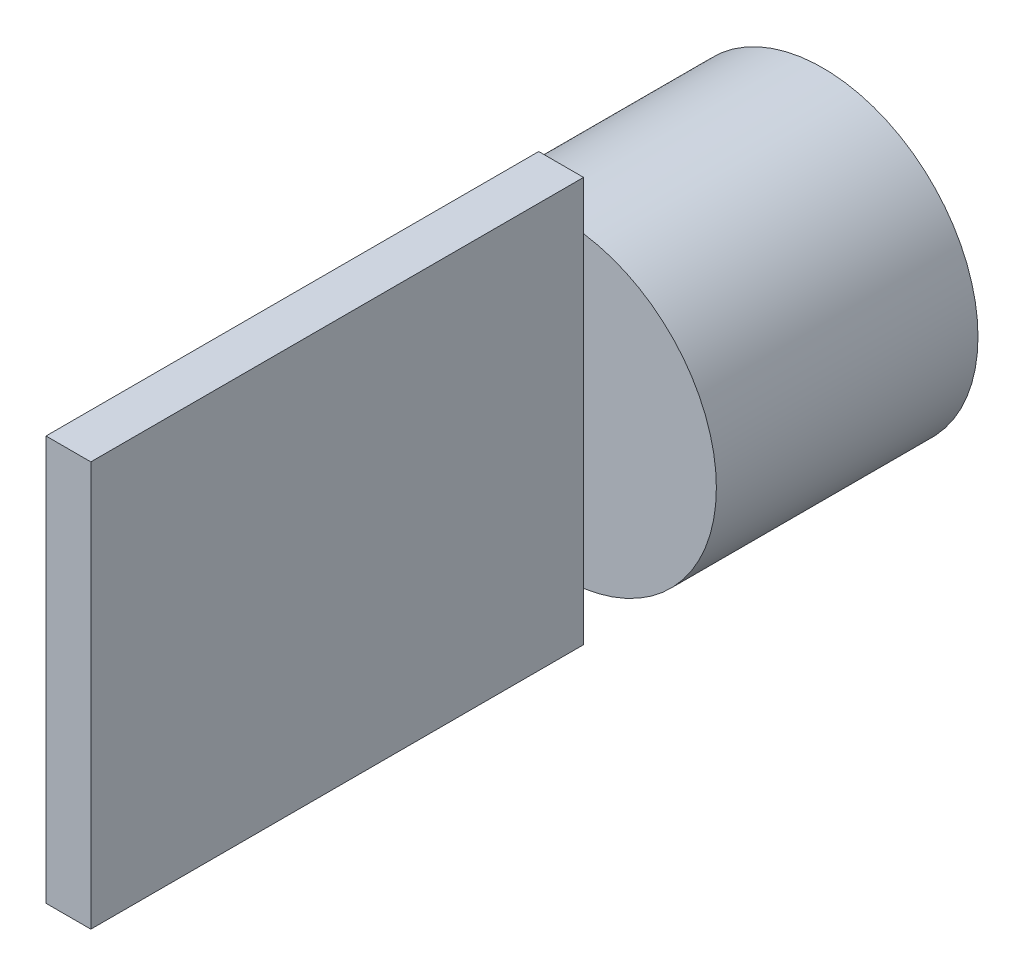
ISO-10303-21;
HEADER;
FILE_DESCRIPTION(('STEP AP214'),'2;1');
FILE_NAME('part.step','',(''),(''),'','','');
FILE_SCHEMA(('AUTOMOTIVE_DESIGN { 1 0 10303 214 1 1 1 1 }'));
ENDSEC;
DATA;
#1=APPLICATION_CONTEXT('core data for automotive mechanical design processes');
#2=APPLICATION_PROTOCOL_DEFINITION('international standard','automotive_design',2000,#1);
#3=PRODUCT_CONTEXT('',#1,'mechanical');
#4=PRODUCT('Part','Part','',(#3));
#5=PRODUCT_RELATED_PRODUCT_CATEGORY('part','',(#4));
#6=PRODUCT_DEFINITION_FORMATION('','',#4);
#7=PRODUCT_DEFINITION_CONTEXT('part definition',#1,'design');
#8=PRODUCT_DEFINITION('design','',#6,#7);
#9=PRODUCT_DEFINITION_SHAPE('','',#8);
#10=(LENGTH_UNIT() NAMED_UNIT(*) SI_UNIT(.MILLI.,.METRE.));
#11=(NAMED_UNIT(*) PLANE_ANGLE_UNIT() SI_UNIT($,.RADIAN.));
#12=(NAMED_UNIT(*) SI_UNIT($,.STERADIAN.) SOLID_ANGLE_UNIT());
#13=UNCERTAINTY_MEASURE_WITH_UNIT(LENGTH_MEASURE(1.E-05),#10,'distance_accuracy_value','');
#14=(GEOMETRIC_REPRESENTATION_CONTEXT(3) GLOBAL_UNCERTAINTY_ASSIGNED_CONTEXT((#13)) GLOBAL_UNIT_ASSIGNED_CONTEXT((#10,
#11,#12)) REPRESENTATION_CONTEXT('',''));
#15=CARTESIAN_POINT('',(0.,0.,0.));
#16=DIRECTION('',(0.,0.,1.));
#17=DIRECTION('',(1.,0.,0.));
#18=AXIS2_PLACEMENT_3D('',#15,#16,#17);
#19=CARTESIAN_POINT('',(0.,0.,60.));
#20=DIRECTION('',(0.,0.,1.));
#21=DIRECTION('',(1.,0.,0.));
#22=AXIS2_PLACEMENT_3D('',#19,#20,#21);
#23=PLANE('',#22);
#24=DIRECTION('',(0.,-1.,0.));
#25=VECTOR('',#24,1.);
#26=CARTESIAN_POINT('',(-5.14155313605641,46.4092822544037,60.));
#27=LINE('',#26,#25);
#28=CARTESIAN_POINT('',(-5.14155313605641,35.2267573209501,60.));
#29=VERTEX_POINT('',#28);
#30=CARTESIAN_POINT('',(-5.14155313605641,-35.2267573209501,60.));
#31=VERTEX_POINT('',#30);
#32=EDGE_CURVE('E11',#29,#31,#27,.T.);
#33=ORIENTED_EDGE('',*,*,#32,.F.);
#34=CARTESIAN_POINT('',(0.,0.,60.));
#35=DIRECTION('',(0.,0.,1.));
#36=DIRECTION('',(1.,0.,0.));
#37=AXIS2_PLACEMENT_3D('',#34,#35,#36);
#38=CIRCLE('',#37,35.6);
#39=EDGE_CURVE('E136',#29,#31,#38,.T.);
#40=ORIENTED_EDGE('',*,*,#39,.T.);
#41=EDGE_LOOP('',(#33,#40));
#42=FACE_BOUND('',#41,.T.);
#43=ADVANCED_FACE('F38',(#42),#23,.T.);
#44=CARTESIAN_POINT('',(0.,0.,60.));
#45=DIRECTION('',(0.,0.,-1.));
#46=DIRECTION('',(-1.,0.,0.));
#47=AXIS2_PLACEMENT_3D('',#44,#45,#46);
#48=CYLINDRICAL_SURFACE('',#47,35.6);
#49=CARTESIAN_POINT('',(5.14155313605641,35.2267573209501,60.));
#50=VERTEX_POINT('',#49);
#51=EDGE_CURVE('E133',#50,#29,#38,.T.);
#52=ORIENTED_EDGE('',*,*,#51,.F.);
#53=CARTESIAN_POINT('',(5.14155313605641,-35.2267573209501,60.));
#54=VERTEX_POINT('',#53);
#55=EDGE_CURVE('E129',#54,#50,#38,.T.);
#56=ORIENTED_EDGE('',*,*,#55,.F.);
#57=EDGE_CURVE('E63',#31,#54,#38,.T.);
#58=ORIENTED_EDGE('',*,*,#57,.F.);
#59=ORIENTED_EDGE('',*,*,#39,.F.);
#60=EDGE_LOOP('',(#52,#56,#58,#59));
#61=FACE_BOUND('',#60,.T.);
#62=CARTESIAN_POINT('',(0.,0.,0.));
#63=DIRECTION('',(0.,0.,1.));
#64=DIRECTION('',(1.,0.,0.));
#65=AXIS2_PLACEMENT_3D('',#62,#63,#64);
#66=CIRCLE('',#65,35.6);
#67=CARTESIAN_POINT('',(35.6,0.,0.));
#68=VERTEX_POINT('',#67);
#69=EDGE_CURVE('E42',#68,#68,#66,.T.);
#70=ORIENTED_EDGE('',*,*,#69,.T.);
#71=EDGE_LOOP('',(#70));
#72=FACE_BOUND('',#71,.T.);
#73=ADVANCED_FACE('F40',(#61,#72),#48,.T.);
#74=DIRECTION('',(0.,1.,0.));
#75=VECTOR('',#74,1.);
#76=CARTESIAN_POINT('',(5.14155313605641,46.4092822544037,60.));
#77=LINE('',#76,#75);
#78=EDGE_CURVE('E48',#54,#50,#77,.T.);
#79=ORIENTED_EDGE('',*,*,#78,.F.);
#80=ORIENTED_EDGE('',*,*,#55,.T.);
#81=EDGE_LOOP('',(#79,#80));
#82=FACE_BOUND('',#81,.T.);
#83=ADVANCED_FACE('F179',(#82),#23,.T.);
#84=CARTESIAN_POINT('',(0.,0.,0.));
#85=DIRECTION('',(0.,0.,1.));
#86=DIRECTION('',(1.,0.,0.));
#87=AXIS2_PLACEMENT_3D('',#84,#85,#86);
#88=PLANE('',#87);
#89=ORIENTED_EDGE('',*,*,#69,.F.);
#90=EDGE_LOOP('',(#89));
#91=FACE_BOUND('',#90,.T.);
#92=ADVANCED_FACE('F182',(#91),#88,.F.);
#93=CARTESIAN_POINT('',(0.,0.,60.));
#94=DIRECTION('',(0.,0.,-1.));
#95=DIRECTION('',(-1.,0.,0.));
#96=AXIS2_PLACEMENT_3D('',#93,#94,#95);
#97=PLANE('',#96);
#98=CARTESIAN_POINT('',(5.14155313605641,46.4092822544037,60.));
#99=VERTEX_POINT('',#98);
#100=EDGE_CURVE('E144',#50,#99,#77,.T.);
#101=ORIENTED_EDGE('',*,*,#100,.F.);
#102=ORIENTED_EDGE('',*,*,#51,.T.);
#103=CARTESIAN_POINT('',(-5.14155313605641,46.4092822544037,60.));
#104=VERTEX_POINT('',#103);
#105=EDGE_CURVE('E50',#104,#29,#27,.T.);
#106=ORIENTED_EDGE('',*,*,#105,.F.);
#107=DIRECTION('',(-1.,0.,0.));
#108=VECTOR('',#107,1.);
#109=CARTESIAN_POINT('',(5.14155313605641,46.4092822544037,60.));
#110=LINE('',#109,#108);
#111=EDGE_CURVE('E118',#99,#104,#110,.T.);
#112=ORIENTED_EDGE('',*,*,#111,.F.);
#113=EDGE_LOOP('',(#101,#102,#106,#112));
#114=FACE_BOUND('',#113,.T.);
#115=ADVANCED_FACE('F168',(#114),#97,.T.);
#116=CARTESIAN_POINT('',(-5.14155313605641,46.4092822544037,173.));
#117=DIRECTION('',(1.,0.,0.));
#118=DIRECTION('',(0.,0.,-1.));
#119=AXIS2_PLACEMENT_3D('',#116,#117,#118);
#120=PLANE('',#119);
#121=ORIENTED_EDGE('',*,*,#105,.T.);
#122=ORIENTED_EDGE('',*,*,#32,.T.);
#123=CARTESIAN_POINT('',(-5.14155313605641,-46.4092822544037,60.));
#124=VERTEX_POINT('',#123);
#125=EDGE_CURVE('E51',#31,#124,#27,.T.);
#126=ORIENTED_EDGE('',*,*,#125,.T.);
#127=DIRECTION('',(0.,0.,-1.));
#128=VECTOR('',#127,1.);
#129=CARTESIAN_POINT('',(-5.14155313605641,-46.4092822544037,173.));
#130=LINE('',#129,#128);
#131=CARTESIAN_POINT('',(-5.14155313605641,-46.4092822544037,173.));
#132=VERTEX_POINT('',#131);
#133=EDGE_CURVE('E101',#132,#124,#130,.T.);
#134=ORIENTED_EDGE('',*,*,#133,.F.);
#135=DIRECTION('',(0.,-1.,0.));
#136=VECTOR('',#135,1.);
#137=CARTESIAN_POINT('',(-5.14155313605641,46.4092822544037,173.));
#138=LINE('',#137,#136);
#139=CARTESIAN_POINT('',(-5.14155313605641,46.4092822544037,173.));
#140=VERTEX_POINT('',#139);
#141=EDGE_CURVE('E108',#140,#132,#138,.T.);
#142=ORIENTED_EDGE('',*,*,#141,.F.);
#143=DIRECTION('',(0.,0.,-1.));
#144=VECTOR('',#143,1.);
#145=CARTESIAN_POINT('',(-5.14155313605641,46.4092822544037,173.));
#146=LINE('',#145,#144);
#147=EDGE_CURVE('E160',#140,#104,#146,.T.);
#148=ORIENTED_EDGE('',*,*,#147,.T.);
#149=EDGE_LOOP('',(#121,#122,#126,#134,#142,#148));
#150=FACE_BOUND('',#149,.T.);
#151=ADVANCED_FACE('F121',(#150),#120,.F.);
#152=CARTESIAN_POINT('',(5.14155313605641,-46.4092822544037,173.));
#153=DIRECTION('',(0.,1.,0.));
#154=DIRECTION('',(0.,0.,1.));
#155=AXIS2_PLACEMENT_3D('',#152,#153,#154);
#156=PLANE('',#155);
#157=DIRECTION('',(1.,0.,0.));
#158=VECTOR('',#157,1.);
#159=CARTESIAN_POINT('',(5.14155313605641,-46.4092822544037,60.));
#160=LINE('',#159,#158);
#161=CARTESIAN_POINT('',(5.14155313605641,-46.4092822544037,60.));
#162=VERTEX_POINT('',#161);
#163=EDGE_CURVE('E157',#124,#162,#160,.T.);
#164=ORIENTED_EDGE('',*,*,#163,.T.);
#165=DIRECTION('',(0.,0.,-1.));
#166=VECTOR('',#165,1.);
#167=CARTESIAN_POINT('',(5.14155313605641,-46.4092822544037,173.));
#168=LINE('',#167,#166);
#169=CARTESIAN_POINT('',(5.14155313605641,-46.4092822544037,173.));
#170=VERTEX_POINT('',#169);
#171=EDGE_CURVE('E103',#170,#162,#168,.T.);
#172=ORIENTED_EDGE('',*,*,#171,.F.);
#173=DIRECTION('',(1.,0.,0.));
#174=VECTOR('',#173,1.);
#175=CARTESIAN_POINT('',(5.14155313605641,-46.4092822544037,173.));
#176=LINE('',#175,#174);
#177=EDGE_CURVE('E97',#132,#170,#176,.T.);
#178=ORIENTED_EDGE('',*,*,#177,.F.);
#179=ORIENTED_EDGE('',*,*,#133,.T.);
#180=EDGE_LOOP('',(#164,#172,#178,#179));
#181=FACE_BOUND('',#180,.T.);
#182=ADVANCED_FACE('F99',(#181),#156,.F.);
#183=CARTESIAN_POINT('',(5.14155313605641,46.4092822544037,173.));
#184=DIRECTION('',(-1.,0.,0.));
#185=DIRECTION('',(0.,0.,1.));
#186=AXIS2_PLACEMENT_3D('',#183,#184,#185);
#187=PLANE('',#186);
#188=EDGE_CURVE('E143',#162,#54,#77,.T.);
#189=ORIENTED_EDGE('',*,*,#188,.T.);
#190=ORIENTED_EDGE('',*,*,#78,.T.);
#191=ORIENTED_EDGE('',*,*,#100,.T.);
#192=DIRECTION('',(0.,0.,-1.));
#193=VECTOR('',#192,1.);
#194=CARTESIAN_POINT('',(5.14155313605641,46.4092822544037,173.));
#195=LINE('',#194,#193);
#196=CARTESIAN_POINT('',(5.14155313605641,46.4092822544037,173.));
#197=VERTEX_POINT('',#196);
#198=EDGE_CURVE('E130',#197,#99,#195,.T.);
#199=ORIENTED_EDGE('',*,*,#198,.F.);
#200=DIRECTION('',(0.,1.,0.));
#201=VECTOR('',#200,1.);
#202=CARTESIAN_POINT('',(5.14155313605641,46.4092822544037,173.));
#203=LINE('',#202,#201);
#204=EDGE_CURVE('E107',#170,#197,#203,.T.);
#205=ORIENTED_EDGE('',*,*,#204,.F.);
#206=ORIENTED_EDGE('',*,*,#171,.T.);
#207=EDGE_LOOP('',(#189,#190,#191,#199,#205,#206));
#208=FACE_BOUND('',#207,.T.);
#209=ADVANCED_FACE('F152',(#208),#187,.F.);
#210=CARTESIAN_POINT('',(5.14155313605641,46.4092822544037,173.));
#211=DIRECTION('',(0.,-1.,0.));
#212=DIRECTION('',(0.,0.,-1.));
#213=AXIS2_PLACEMENT_3D('',#210,#211,#212);
#214=PLANE('',#213);
#215=ORIENTED_EDGE('',*,*,#111,.T.);
#216=ORIENTED_EDGE('',*,*,#147,.F.);
#217=DIRECTION('',(-1.,0.,0.));
#218=VECTOR('',#217,1.);
#219=CARTESIAN_POINT('',(5.14155313605641,46.4092822544037,173.));
#220=LINE('',#219,#218);
#221=EDGE_CURVE('E113',#197,#140,#220,.T.);
#222=ORIENTED_EDGE('',*,*,#221,.F.);
#223=ORIENTED_EDGE('',*,*,#198,.T.);
#224=EDGE_LOOP('',(#215,#216,#222,#223));
#225=FACE_BOUND('',#224,.T.);
#226=ADVANCED_FACE('F167',(#225),#214,.F.);
#227=CARTESIAN_POINT('',(0.,0.,173.));
#228=DIRECTION('',(0.,0.,-1.));
#229=DIRECTION('',(-1.,0.,0.));
#230=AXIS2_PLACEMENT_3D('',#227,#228,#229);
#231=PLANE('',#230);
#232=ORIENTED_EDGE('',*,*,#141,.T.);
#233=ORIENTED_EDGE('',*,*,#177,.T.);
#234=ORIENTED_EDGE('',*,*,#204,.T.);
#235=ORIENTED_EDGE('',*,*,#221,.T.);
#236=EDGE_LOOP('',(#232,#233,#234,#235));
#237=FACE_BOUND('',#236,.T.);
#238=ADVANCED_FACE('F111',(#237),#231,.F.);
#239=ORIENTED_EDGE('',*,*,#125,.F.);
#240=ORIENTED_EDGE('',*,*,#57,.T.);
#241=ORIENTED_EDGE('',*,*,#188,.F.);
#242=ORIENTED_EDGE('',*,*,#163,.F.);
#243=EDGE_LOOP('',(#239,#240,#241,#242));
#244=FACE_BOUND('',#243,.T.);
#245=ADVANCED_FACE('F150',(#244),#97,.T.);
#246=CLOSED_SHELL('',(#43,#73,#83,#92,#115,#151,#182,#209,#226,#238,#245));
#247=MANIFOLD_SOLID_BREP('B2',#246);
#248=ADVANCED_BREP_SHAPE_REPRESENTATION('',(#18,#247),#14);
#249=SHAPE_DEFINITION_REPRESENTATION(#9,#248);
ENDSEC;
END-ISO-10303-21;
